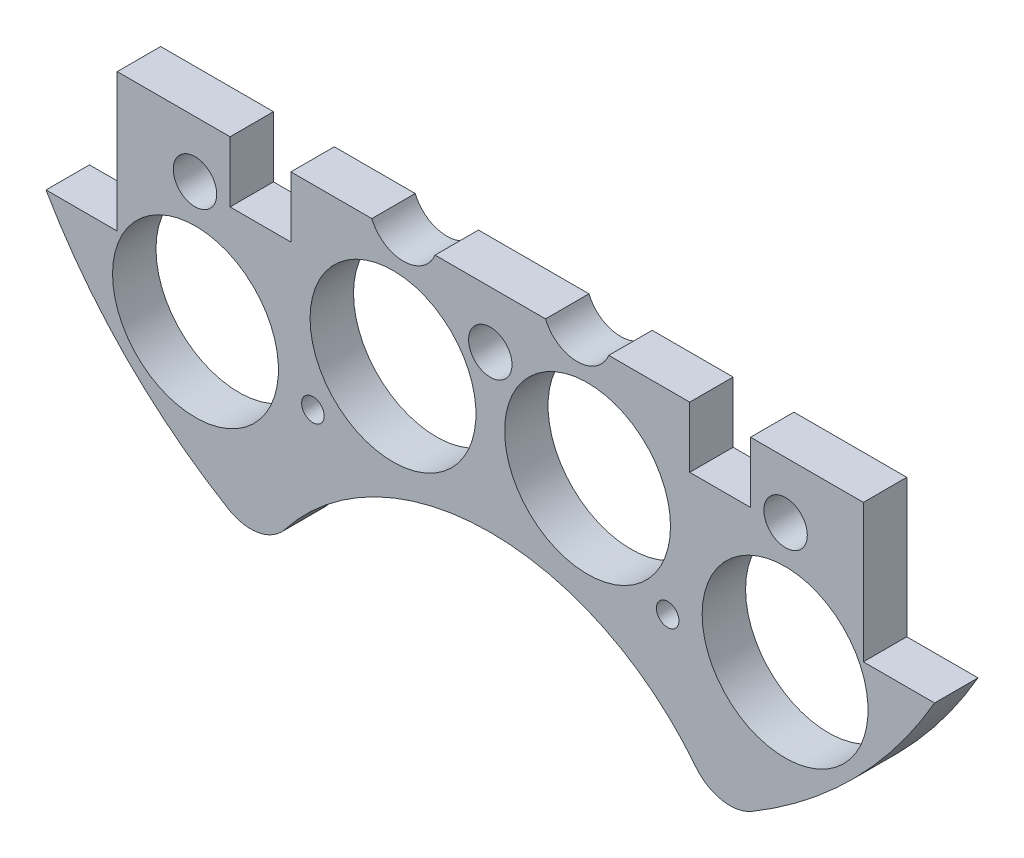
ISO-10303-21;
HEADER;
FILE_DESCRIPTION(('STEP AP214'),'2;1');
FILE_NAME('part.step','',(''),(''),'','','');
FILE_SCHEMA(('AUTOMOTIVE_DESIGN { 1 0 10303 214 1 1 1 1 }'));
ENDSEC;
DATA;
#1=APPLICATION_CONTEXT('core data for automotive mechanical design processes');
#2=APPLICATION_PROTOCOL_DEFINITION('international standard','automotive_design',2000,#1);
#3=PRODUCT_CONTEXT('',#1,'mechanical');
#4=PRODUCT('Part','Part','',(#3));
#5=PRODUCT_RELATED_PRODUCT_CATEGORY('part','',(#4));
#6=PRODUCT_DEFINITION_FORMATION('','',#4);
#7=PRODUCT_DEFINITION_CONTEXT('part definition',#1,'design');
#8=PRODUCT_DEFINITION('design','',#6,#7);
#9=PRODUCT_DEFINITION_SHAPE('','',#8);
#10=(LENGTH_UNIT() NAMED_UNIT(*) SI_UNIT(.MILLI.,.METRE.));
#11=(NAMED_UNIT(*) PLANE_ANGLE_UNIT() SI_UNIT($,.RADIAN.));
#12=(NAMED_UNIT(*) SI_UNIT($,.STERADIAN.) SOLID_ANGLE_UNIT());
#13=UNCERTAINTY_MEASURE_WITH_UNIT(LENGTH_MEASURE(1.E-05),#10,'distance_accuracy_value','');
#14=(GEOMETRIC_REPRESENTATION_CONTEXT(3) GLOBAL_UNCERTAINTY_ASSIGNED_CONTEXT((#13)) GLOBAL_UNIT_ASSIGNED_CONTEXT((#10,
#11,#12)) REPRESENTATION_CONTEXT('',''));
#15=CARTESIAN_POINT('',(0.,0.,0.));
#16=DIRECTION('',(0.,0.,1.));
#17=DIRECTION('',(1.,0.,0.));
#18=AXIS2_PLACEMENT_3D('',#15,#16,#17);
#19=CARTESIAN_POINT('',(85.0440360772851,-17.145,6.35));
#20=DIRECTION('',(0.,-1.,0.));
#21=DIRECTION('',(0.,0.,-1.));
#22=AXIS2_PLACEMENT_3D('',#19,#20,#21);
#23=PLANE('',#22);
#24=DIRECTION('',(-1.,0.,0.));
#25=VECTOR('',#24,1.);
#26=CARTESIAN_POINT('',(85.0440360772851,-17.145,6.35));
#27=LINE('',#26,#25);
#28=CARTESIAN_POINT('',(-17.3228751875862,-17.145,6.35));
#29=VERTEX_POINT('',#28);
#30=CARTESIAN_POINT('',(-29.1604414737786,-17.145,6.35));
#31=VERTEX_POINT('',#30);
#32=EDGE_CURVE('E197',#29,#31,#27,.T.);
#33=ORIENTED_EDGE('',*,*,#32,.F.);
#34=DIRECTION('',(0.,0.,-1.));
#35=VECTOR('',#34,1.);
#36=CARTESIAN_POINT('',(-17.3228751875862,-17.145,10.));
#37=LINE('',#36,#35);
#38=CARTESIAN_POINT('',(-17.3228751875862,-17.145,0.));
#39=VERTEX_POINT('',#38);
#40=EDGE_CURVE('E183',#29,#39,#37,.T.);
#41=ORIENTED_EDGE('',*,*,#40,.T.);
#42=DIRECTION('',(-1.,0.,0.));
#43=VECTOR('',#42,1.);
#44=CARTESIAN_POINT('',(85.0440360772851,-17.145,0.));
#45=LINE('',#44,#43);
#46=CARTESIAN_POINT('',(-29.1604414737786,-17.145,0.));
#47=VERTEX_POINT('',#46);
#48=EDGE_CURVE('E195',#39,#47,#45,.T.);
#49=ORIENTED_EDGE('',*,*,#48,.T.);
#50=DIRECTION('',(0.,0.,-1.));
#51=VECTOR('',#50,1.);
#52=CARTESIAN_POINT('',(-29.1604414737786,-17.145,6.35));
#53=LINE('',#52,#51);
#54=EDGE_CURVE('E256',#31,#47,#53,.T.);
#55=ORIENTED_EDGE('',*,*,#54,.F.);
#56=EDGE_LOOP('',(#33,#41,#49,#55));
#57=FACE_BOUND('',#56,.T.);
#58=ADVANCED_FACE('F33',(#57),#23,.F.);
#59=CARTESIAN_POINT('',(8.07712481241381,-17.145,0.));
#60=VERTEX_POINT('',#59);
#61=CARTESIAN_POINT('',(-8.07712481241381,-17.145,0.));
#62=VERTEX_POINT('',#61);
#63=EDGE_CURVE('E205',#60,#62,#45,.T.);
#64=ORIENTED_EDGE('',*,*,#63,.T.);
#65=DIRECTION('',(0.,0.,-1.));
#66=VECTOR('',#65,1.);
#67=CARTESIAN_POINT('',(-8.07712481241381,-17.145,10.));
#68=LINE('',#67,#66);
#69=CARTESIAN_POINT('',(-8.07712481241381,-17.145,6.35));
#70=VERTEX_POINT('',#69);
#71=EDGE_CURVE('E50',#62,#70,#68,.F.);
#72=ORIENTED_EDGE('',*,*,#71,.T.);
#73=CARTESIAN_POINT('',(8.07712481241381,-17.145,6.35));
#74=VERTEX_POINT('',#73);
#75=EDGE_CURVE('E219',#74,#70,#27,.T.);
#76=ORIENTED_EDGE('',*,*,#75,.F.);
#77=DIRECTION('',(0.,0.,-1.));
#78=VECTOR('',#77,1.);
#79=CARTESIAN_POINT('',(8.07712481241381,-17.145,10.));
#80=LINE('',#79,#78);
#81=EDGE_CURVE('E238',#74,#60,#80,.T.);
#82=ORIENTED_EDGE('',*,*,#81,.T.);
#83=EDGE_LOOP('',(#64,#72,#76,#82));
#84=FACE_BOUND('',#83,.T.);
#85=ADVANCED_FACE('F304',(#84),#23,.F.);
#86=CARTESIAN_POINT('',(29.1604414737786,-17.145,0.));
#87=VERTEX_POINT('',#86);
#88=CARTESIAN_POINT('',(17.3228751875862,-17.145,0.));
#89=VERTEX_POINT('',#88);
#90=EDGE_CURVE('E209',#87,#89,#45,.T.);
#91=ORIENTED_EDGE('',*,*,#90,.T.);
#92=DIRECTION('',(0.,0.,-1.));
#93=VECTOR('',#92,1.);
#94=CARTESIAN_POINT('',(17.3228751875862,-17.145,10.));
#95=LINE('',#94,#93);
#96=CARTESIAN_POINT('',(17.3228751875862,-17.145,6.35));
#97=VERTEX_POINT('',#96);
#98=EDGE_CURVE('E58',#89,#97,#95,.F.);
#99=ORIENTED_EDGE('',*,*,#98,.T.);
#100=CARTESIAN_POINT('',(29.1604414737786,-17.145,6.35));
#101=VERTEX_POINT('',#100);
#102=EDGE_CURVE('E218',#101,#97,#27,.T.);
#103=ORIENTED_EDGE('',*,*,#102,.F.);
#104=DIRECTION('',(0.,0.,-1.));
#105=VECTOR('',#104,1.);
#106=CARTESIAN_POINT('',(29.1604414737786,-17.145,6.35));
#107=LINE('',#106,#105);
#108=EDGE_CURVE('E227',#101,#87,#107,.T.);
#109=ORIENTED_EDGE('',*,*,#108,.T.);
#110=EDGE_LOOP('',(#91,#99,#103,#109));
#111=FACE_BOUND('',#110,.T.);
#112=ADVANCED_FACE('F224',(#111),#23,.F.);
#113=CARTESIAN_POINT('',(54.5504414737786,-17.145,0.));
#114=VERTEX_POINT('',#113);
#115=CARTESIAN_POINT('',(38.0504414737786,-17.145,0.));
#116=VERTEX_POINT('',#115);
#117=EDGE_CURVE('E208',#114,#116,#45,.T.);
#118=ORIENTED_EDGE('',*,*,#117,.T.);
#119=DIRECTION('',(0.,0.,-1.));
#120=VECTOR('',#119,1.);
#121=CARTESIAN_POINT('',(38.0504414737786,-17.145,6.35));
#122=LINE('',#121,#120);
#123=CARTESIAN_POINT('',(38.0504414737786,-17.145,6.35));
#124=VERTEX_POINT('',#123);
#125=EDGE_CURVE('E281',#124,#116,#122,.T.);
#126=ORIENTED_EDGE('',*,*,#125,.F.);
#127=CARTESIAN_POINT('',(54.5504414737786,-17.145,6.35));
#128=VERTEX_POINT('',#127);
#129=EDGE_CURVE('E290',#128,#124,#27,.T.);
#130=ORIENTED_EDGE('',*,*,#129,.F.);
#131=DIRECTION('',(0.,0.,1.));
#132=VECTOR('',#131,1.);
#133=CARTESIAN_POINT('',(54.5504414737786,-17.145,6.35));
#134=LINE('',#133,#132);
#135=EDGE_CURVE('E670',#114,#128,#134,.T.);
#136=ORIENTED_EDGE('',*,*,#135,.F.);
#137=EDGE_LOOP('',(#118,#126,#130,#136));
#138=FACE_BOUND('',#137,.T.);
#139=ADVANCED_FACE('F354',(#138),#23,.F.);
#140=CARTESIAN_POINT('',(0.,0.,6.35));
#141=DIRECTION('',(0.,0.,-1.));
#142=DIRECTION('',(-1.,0.,0.));
#143=AXIS2_PLACEMENT_3D('',#140,#141,#142);
#144=CYLINDRICAL_SURFACE('',#143,74.93);
#145=CARTESIAN_POINT('',(0.,0.,0.));
#146=DIRECTION('',(0.,0.,1.));
#147=DIRECTION('',(1.,0.,0.));
#148=AXIS2_PLACEMENT_3D('',#145,#146,#147);
#149=CIRCLE('',#148,74.93);
#150=CARTESIAN_POINT('',(-64.9644414737785,-37.338,0.));
#151=VERTEX_POINT('',#150);
#152=CARTESIAN_POINT('',(-38.2787319784796,-64.4146223936749,0.));
#153=VERTEX_POINT('',#152);
#154=EDGE_CURVE('E652',#151,#153,#149,.T.);
#155=ORIENTED_EDGE('',*,*,#154,.T.);
#156=DIRECTION('',(0.,0.,-1.));
#157=VECTOR('',#156,1.);
#158=CARTESIAN_POINT('',(-38.2787319784796,-64.4146223936749,6.35));
#159=LINE('',#158,#157);
#160=CARTESIAN_POINT('',(-38.2787319784796,-64.4146223936749,6.35));
#161=VERTEX_POINT('',#160);
#162=EDGE_CURVE('E673',#153,#161,#159,.F.);
#163=ORIENTED_EDGE('',*,*,#162,.T.);
#164=CARTESIAN_POINT('',(0.,0.,6.35));
#165=DIRECTION('',(0.,0.,1.));
#166=DIRECTION('',(1.,0.,0.));
#167=AXIS2_PLACEMENT_3D('',#164,#165,#166);
#168=CIRCLE('',#167,74.93);
#169=CARTESIAN_POINT('',(-64.9644414737785,-37.338,6.35));
#170=VERTEX_POINT('',#169);
#171=EDGE_CURVE('E640',#170,#161,#168,.T.);
#172=ORIENTED_EDGE('',*,*,#171,.F.);
#173=DIRECTION('',(0.,0.,-1.));
#174=VECTOR('',#173,1.);
#175=CARTESIAN_POINT('',(-64.9644414737785,-37.338,6.35));
#176=LINE('',#175,#174);
#177=EDGE_CURVE('E664',#170,#151,#176,.T.);
#178=ORIENTED_EDGE('',*,*,#177,.T.);
#179=EDGE_LOOP('',(#155,#163,#172,#178));
#180=FACE_BOUND('',#179,.T.);
#181=ADVANCED_FACE('F366',(#180),#144,.T.);
#182=CARTESIAN_POINT('',(0.,0.,6.35));
#183=DIRECTION('',(0.,0.,1.));
#184=DIRECTION('',(1.,0.,0.));
#185=AXIS2_PLACEMENT_3D('',#182,#183,#184);
#186=PLANE('',#185);
#187=CARTESIAN_POINT('',(-25.9376089894497,-45.645229381132,6.34999999999999));
#188=DIRECTION('',(0.,0.,1.));
#189=DIRECTION('',(1.,0.,0.));
#190=AXIS2_PLACEMENT_3D('',#187,#188,#189);
#191=CIRCLE('',#190,1.651);
#192=CARTESIAN_POINT('',(-24.2866089894497,-45.645229381132,6.34999999999999));
#193=VERTEX_POINT('',#192);
#194=EDGE_CURVE('E322',#193,#193,#191,.T.);
#195=ORIENTED_EDGE('',*,*,#194,.F.);
#196=EDGE_LOOP('',(#195));
#197=FACE_BOUND('',#196,.T.);
#198=CARTESIAN_POINT('',(25.9376089894497,-45.645229381132,6.34999999999999));
#199=DIRECTION('',(0.,0.,1.));
#200=DIRECTION('',(1.,0.,0.));
#201=AXIS2_PLACEMENT_3D('',#198,#199,#200);
#202=CIRCLE('',#201,1.651);
#203=CARTESIAN_POINT('',(27.5886089894497,-45.645229381132,6.34999999999999));
#204=VERTEX_POINT('',#203);
#205=EDGE_CURVE('E318',#204,#204,#202,.T.);
#206=ORIENTED_EDGE('',*,*,#205,.F.);
#207=EDGE_LOOP('',(#206));
#208=FACE_BOUND('',#207,.T.);
#209=CARTESIAN_POINT('',(-43.18,-25.4,6.34999999999999));
#210=DIRECTION('',(0.,0.,1.));
#211=DIRECTION('',(1.,0.,0.));
#212=AXIS2_PLACEMENT_3D('',#209,#210,#211);
#213=CIRCLE('',#212,3.175);
#214=CARTESIAN_POINT('',(-40.005,-25.4,6.34999999999999));
#215=VERTEX_POINT('',#214);
#216=EDGE_CURVE('E190',#215,#215,#213,.F.);
#217=ORIENTED_EDGE('',*,*,#216,.T.);
#218=EDGE_LOOP('',(#217));
#219=FACE_BOUND('',#218,.T.);
#220=CARTESIAN_POINT('',(0.,-25.4,6.34999999999999));
#221=DIRECTION('',(0.,0.,1.));
#222=DIRECTION('',(1.,0.,0.));
#223=AXIS2_PLACEMENT_3D('',#220,#221,#222);
#224=CIRCLE('',#223,3.175);
#225=CARTESIAN_POINT('',(3.17500000000001,-25.4,6.34999999999999));
#226=VERTEX_POINT('',#225);
#227=EDGE_CURVE('E310',#226,#226,#224,.F.);
#228=ORIENTED_EDGE('',*,*,#227,.T.);
#229=EDGE_LOOP('',(#228));
#230=FACE_BOUND('',#229,.T.);
#231=CARTESIAN_POINT('',(43.18,-25.4,6.34999999999999));
#232=DIRECTION('',(0.,0.,1.));
#233=DIRECTION('',(1.,0.,0.));
#234=AXIS2_PLACEMENT_3D('',#231,#232,#233);
#235=CIRCLE('',#234,3.175);
#236=CARTESIAN_POINT('',(46.355,-25.4,6.34999999999999));
#237=VERTEX_POINT('',#236);
#238=EDGE_CURVE('E314',#237,#237,#235,.F.);
#239=ORIENTED_EDGE('',*,*,#238,.T.);
#240=EDGE_LOOP('',(#239));
#241=FACE_BOUND('',#240,.T.);
#242=CARTESIAN_POINT('',(-12.7,-15.24,6.35));
#243=DIRECTION('',(0.,0.,1.));
#244=DIRECTION('',(1.,0.,0.));
#245=AXIS2_PLACEMENT_3D('',#242,#243,#244);
#246=CIRCLE('',#245,5.);
#247=EDGE_CURVE('E189',#29,#70,#246,.T.);
#248=ORIENTED_EDGE('',*,*,#247,.F.);
#249=ORIENTED_EDGE('',*,*,#32,.T.);
#250=DIRECTION('',(0.,-1.,0.));
#251=VECTOR('',#250,1.);
#252=CARTESIAN_POINT('',(-29.1604414737786,-17.145,6.35));
#253=LINE('',#252,#251);
#254=CARTESIAN_POINT('',(-29.1604414737786,-26.035,6.35));
#255=VERTEX_POINT('',#254);
#256=EDGE_CURVE('E240',#31,#255,#253,.T.);
#257=ORIENTED_EDGE('',*,*,#256,.T.);
#258=DIRECTION('',(-1.,0.,0.));
#259=VECTOR('',#258,1.);
#260=CARTESIAN_POINT('',(-29.1604414737786,-26.035,6.35));
#261=LINE('',#260,#259);
#262=CARTESIAN_POINT('',(-38.0504414737786,-26.035,6.35));
#263=VERTEX_POINT('',#262);
#264=EDGE_CURVE('E243',#255,#263,#261,.T.);
#265=ORIENTED_EDGE('',*,*,#264,.T.);
#266=DIRECTION('',(0.,1.,0.));
#267=VECTOR('',#266,1.);
#268=CARTESIAN_POINT('',(-38.0504414737786,-17.145,6.35));
#269=LINE('',#268,#267);
#270=CARTESIAN_POINT('',(-38.0504414737786,-17.145,6.35));
#271=VERTEX_POINT('',#270);
#272=EDGE_CURVE('E247',#263,#271,#269,.T.);
#273=ORIENTED_EDGE('',*,*,#272,.T.);
#274=CARTESIAN_POINT('',(-54.5504414737786,-17.145,6.35));
#275=VERTEX_POINT('',#274);
#276=EDGE_CURVE('E214',#271,#275,#27,.T.);
#277=ORIENTED_EDGE('',*,*,#276,.T.);
#278=DIRECTION('',(0.,-1.,0.));
#279=VECTOR('',#278,1.);
#280=CARTESIAN_POINT('',(-54.5504414737786,37.338,6.35));
#281=LINE('',#280,#279);
#282=CARTESIAN_POINT('',(-54.5504414737786,-37.338,6.35));
#283=VERTEX_POINT('',#282);
#284=EDGE_CURVE('E634',#275,#283,#281,.T.);
#285=ORIENTED_EDGE('',*,*,#284,.T.);
#286=DIRECTION('',(-1.,0.,0.));
#287=VECTOR('',#286,1.);
#288=CARTESIAN_POINT('',(-64.9644414737785,-37.338,6.35));
#289=LINE('',#288,#287);
#290=EDGE_CURVE('E636',#283,#170,#289,.T.);
#291=ORIENTED_EDGE('',*,*,#290,.T.);
#292=ORIENTED_EDGE('',*,*,#171,.T.);
#293=CARTESIAN_POINT('',(-35.0347716413203,-58.9557560891262,6.35));
#294=DIRECTION('',(0.,0.,1.));
#295=DIRECTION('',(1.,0.,0.));
#296=AXIS2_PLACEMENT_3D('',#293,#294,#295);
#297=CIRCLE('',#296,6.35);
#298=CARTESIAN_POINT('',(-30.0298042639888,-62.8637992761762,6.35));
#299=VERTEX_POINT('',#298);
#300=EDGE_CURVE('E676',#161,#299,#297,.T.);
#301=ORIENTED_EDGE('',*,*,#300,.T.);
#302=CARTESIAN_POINT('',(0.,-86.312058398476,6.35));
#303=DIRECTION('',(0.,0.,1.));
#304=DIRECTION('',(1.,0.,0.));
#305=AXIS2_PLACEMENT_3D('',#302,#303,#304);
#306=CIRCLE('',#305,38.1);
#307=CARTESIAN_POINT('',(30.0298042639888,-62.8637992761762,6.35));
#308=VERTEX_POINT('',#307);
#309=EDGE_CURVE('E210',#308,#299,#306,.T.);
#310=ORIENTED_EDGE('',*,*,#309,.F.);
#311=CARTESIAN_POINT('',(35.0347716413203,-58.9557560891262,6.35));
#312=DIRECTION('',(0.,0.,1.));
#313=DIRECTION('',(1.,0.,0.));
#314=AXIS2_PLACEMENT_3D('',#311,#312,#313);
#315=CIRCLE('',#314,6.35);
#316=CARTESIAN_POINT('',(38.2787319784796,-64.4146223936749,6.35));
#317=VERTEX_POINT('',#316);
#318=EDGE_CURVE('E11',#308,#317,#315,.T.);
#319=ORIENTED_EDGE('',*,*,#318,.T.);
#320=CARTESIAN_POINT('',(64.9644414737785,-37.338,6.35));
#321=VERTEX_POINT('',#320);
#322=EDGE_CURVE('E639',#317,#321,#168,.T.);
#323=ORIENTED_EDGE('',*,*,#322,.T.);
#324=DIRECTION('',(-1.,0.,0.));
#325=VECTOR('',#324,1.);
#326=CARTESIAN_POINT('',(64.9644414737785,-37.338,6.35));
#327=LINE('',#326,#325);
#328=CARTESIAN_POINT('',(54.5504414737786,-37.338,6.35));
#329=VERTEX_POINT('',#328);
#330=EDGE_CURVE('E643',#321,#329,#327,.T.);
#331=ORIENTED_EDGE('',*,*,#330,.T.);
#332=DIRECTION('',(0.,1.,0.));
#333=VECTOR('',#332,1.);
#334=CARTESIAN_POINT('',(54.5504414737786,37.338,6.35));
#335=LINE('',#334,#333);
#336=EDGE_CURVE('E645',#329,#128,#335,.T.);
#337=ORIENTED_EDGE('',*,*,#336,.T.);
#338=ORIENTED_EDGE('',*,*,#129,.T.);
#339=DIRECTION('',(0.,-1.,0.));
#340=VECTOR('',#339,1.);
#341=CARTESIAN_POINT('',(38.0504414737786,-17.145,6.35));
#342=LINE('',#341,#340);
#343=CARTESIAN_POINT('',(38.0504414737786,-26.035,6.35));
#344=VERTEX_POINT('',#343);
#345=EDGE_CURVE('E265',#124,#344,#342,.T.);
#346=ORIENTED_EDGE('',*,*,#345,.T.);
#347=DIRECTION('',(-1.,0.,0.));
#348=VECTOR('',#347,1.);
#349=CARTESIAN_POINT('',(38.0504414737786,-26.035,6.35));
#350=LINE('',#349,#348);
#351=CARTESIAN_POINT('',(29.1604414737786,-26.035,6.35));
#352=VERTEX_POINT('',#351);
#353=EDGE_CURVE('E268',#344,#352,#350,.T.);
#354=ORIENTED_EDGE('',*,*,#353,.T.);
#355=DIRECTION('',(0.,1.,0.));
#356=VECTOR('',#355,1.);
#357=CARTESIAN_POINT('',(29.1604414737786,-17.145,6.35));
#358=LINE('',#357,#356);
#359=EDGE_CURVE('E271',#352,#101,#358,.T.);
#360=ORIENTED_EDGE('',*,*,#359,.T.);
#361=ORIENTED_EDGE('',*,*,#102,.T.);
#362=CARTESIAN_POINT('',(12.7,-15.24,6.35));
#363=DIRECTION('',(0.,0.,1.));
#364=DIRECTION('',(1.,0.,0.));
#365=AXIS2_PLACEMENT_3D('',#362,#363,#364);
#366=CIRCLE('',#365,5.);
#367=EDGE_CURVE('E232',#74,#97,#366,.T.);
#368=ORIENTED_EDGE('',*,*,#367,.F.);
#369=ORIENTED_EDGE('',*,*,#75,.T.);
#370=EDGE_LOOP('',(#248,#249,#257,#265,#273,#277,#285,#291,#292,#301,#310,#319,#323,#331,#337,
#338,#346,#354,#360,#361,#368,#369));
#371=FACE_BOUND('',#370,.T.);
#372=CARTESIAN_POINT('',(-43.105229381132,-43.1052293811318,6.35));
#373=DIRECTION('',(0.,0.,-1.));
#374=DIRECTION('',(-1.,0.,0.));
#375=AXIS2_PLACEMENT_3D('',#372,#373,#374);
#376=CIRCLE('',#375,12.1285);
#377=CARTESIAN_POINT('',(-55.233729381132,-43.1052293811318,6.35));
#378=VERTEX_POINT('',#377);
#379=EDGE_CURVE('E722',#378,#378,#376,.T.);
#380=ORIENTED_EDGE('',*,*,#379,.T.);
#381=EDGE_LOOP('',(#380));
#382=FACE_BOUND('',#381,.T.);
#383=CARTESIAN_POINT('',(14.224,-34.29,6.35));
#384=DIRECTION('',(0.,0.,-1.));
#385=DIRECTION('',(1.,0.,0.));
#386=AXIS2_PLACEMENT_3D('',#383,#384,#385);
#387=CIRCLE('',#386,12.1285);
#388=CARTESIAN_POINT('',(26.3525,-34.29,6.35));
#389=VERTEX_POINT('',#388);
#390=EDGE_CURVE('E719',#389,#389,#387,.T.);
#391=ORIENTED_EDGE('',*,*,#390,.T.);
#392=EDGE_LOOP('',(#391));
#393=FACE_BOUND('',#392,.T.);
#394=CARTESIAN_POINT('',(43.1052293811319,-43.105229381132,6.35));
#395=DIRECTION('',(0.,0.,-1.));
#396=DIRECTION('',(-1.,0.,0.));
#397=AXIS2_PLACEMENT_3D('',#394,#395,#396);
#398=CIRCLE('',#397,12.1285);
#399=CARTESIAN_POINT('',(30.9767293811319,-43.105229381132,6.35));
#400=VERTEX_POINT('',#399);
#401=EDGE_CURVE('E625',#400,#400,#398,.T.);
#402=ORIENTED_EDGE('',*,*,#401,.T.);
#403=EDGE_LOOP('',(#402));
#404=FACE_BOUND('',#403,.T.);
#405=CARTESIAN_POINT('',(-14.224,-34.29,6.35));
#406=DIRECTION('',(0.,0.,-1.));
#407=DIRECTION('',(-1.,0.,0.));
#408=AXIS2_PLACEMENT_3D('',#405,#406,#407);
#409=CIRCLE('',#408,12.1285);
#410=CARTESIAN_POINT('',(-26.3525,-34.29,6.35));
#411=VERTEX_POINT('',#410);
#412=EDGE_CURVE('E624',#411,#411,#409,.T.);
#413=ORIENTED_EDGE('',*,*,#412,.T.);
#414=EDGE_LOOP('',(#413));
#415=FACE_BOUND('',#414,.T.);
#416=ADVANCED_FACE('F301',(#197,#208,#219,#230,#241,#371,#382,#393,#404,#415),#186,.T.);
#417=CARTESIAN_POINT('',(0.,0.,0.));
#418=DIRECTION('',(0.,0.,1.));
#419=DIRECTION('',(1.,0.,0.));
#420=AXIS2_PLACEMENT_3D('',#417,#418,#419);
#421=PLANE('',#420);
#422=CARTESIAN_POINT('',(-25.9376089894497,-45.645229381132,0.));
#423=DIRECTION('',(0.,0.,1.));
#424=DIRECTION('',(1.,0.,0.));
#425=AXIS2_PLACEMENT_3D('',#422,#423,#424);
#426=CIRCLE('',#425,1.651);
#427=CARTESIAN_POINT('',(-24.2866089894497,-45.645229381132,0.));
#428=VERTEX_POINT('',#427);
#429=EDGE_CURVE('E37',#428,#428,#426,.T.);
#430=ORIENTED_EDGE('',*,*,#429,.T.);
#431=EDGE_LOOP('',(#430));
#432=FACE_BOUND('',#431,.T.);
#433=CARTESIAN_POINT('',(25.9376089894497,-45.645229381132,0.));
#434=DIRECTION('',(0.,0.,1.));
#435=DIRECTION('',(1.,0.,0.));
#436=AXIS2_PLACEMENT_3D('',#433,#434,#435);
#437=CIRCLE('',#436,1.651);
#438=CARTESIAN_POINT('',(27.5886089894497,-45.645229381132,0.));
#439=VERTEX_POINT('',#438);
#440=EDGE_CURVE('E321',#439,#439,#437,.T.);
#441=ORIENTED_EDGE('',*,*,#440,.T.);
#442=EDGE_LOOP('',(#441));
#443=FACE_BOUND('',#442,.T.);
#444=CARTESIAN_POINT('',(-43.18,-25.4,0.));
#445=DIRECTION('',(0.,0.,1.));
#446=DIRECTION('',(1.,0.,0.));
#447=AXIS2_PLACEMENT_3D('',#444,#445,#446);
#448=CIRCLE('',#447,3.175);
#449=CARTESIAN_POINT('',(-40.005,-25.4,0.));
#450=VERTEX_POINT('',#449);
#451=EDGE_CURVE('E309',#450,#450,#448,.F.);
#452=ORIENTED_EDGE('',*,*,#451,.F.);
#453=EDGE_LOOP('',(#452));
#454=FACE_BOUND('',#453,.T.);
#455=CARTESIAN_POINT('',(0.,-25.4,0.));
#456=DIRECTION('',(0.,0.,1.));
#457=DIRECTION('',(1.,0.,0.));
#458=AXIS2_PLACEMENT_3D('',#455,#456,#457);
#459=CIRCLE('',#458,3.175);
#460=CARTESIAN_POINT('',(3.17500000000001,-25.4,0.));
#461=VERTEX_POINT('',#460);
#462=EDGE_CURVE('E313',#461,#461,#459,.F.);
#463=ORIENTED_EDGE('',*,*,#462,.F.);
#464=EDGE_LOOP('',(#463));
#465=FACE_BOUND('',#464,.T.);
#466=CARTESIAN_POINT('',(43.18,-25.4,0.));
#467=DIRECTION('',(0.,0.,1.));
#468=DIRECTION('',(1.,0.,0.));
#469=AXIS2_PLACEMENT_3D('',#466,#467,#468);
#470=CIRCLE('',#469,3.175);
#471=CARTESIAN_POINT('',(46.355,-25.4,0.));
#472=VERTEX_POINT('',#471);
#473=EDGE_CURVE('E317',#472,#472,#470,.F.);
#474=ORIENTED_EDGE('',*,*,#473,.F.);
#475=EDGE_LOOP('',(#474));
#476=FACE_BOUND('',#475,.T.);
#477=CARTESIAN_POINT('',(-43.105229381132,-43.1052293811318,0.));
#478=DIRECTION('',(0.,0.,-1.));
#479=DIRECTION('',(-1.,0.,0.));
#480=AXIS2_PLACEMENT_3D('',#477,#478,#479);
#481=CIRCLE('',#480,12.1285);
#482=CARTESIAN_POINT('',(-55.233729381132,-43.1052293811318,0.));
#483=VERTEX_POINT('',#482);
#484=EDGE_CURVE('E296',#483,#483,#481,.T.);
#485=ORIENTED_EDGE('',*,*,#484,.F.);
#486=EDGE_LOOP('',(#485));
#487=FACE_BOUND('',#486,.T.);
#488=CARTESIAN_POINT('',(14.224,-34.29,0.));
#489=DIRECTION('',(0.,0.,-1.));
#490=DIRECTION('',(1.,0.,0.));
#491=AXIS2_PLACEMENT_3D('',#488,#489,#490);
#492=CIRCLE('',#491,12.1285);
#493=CARTESIAN_POINT('',(26.3525,-34.29,0.));
#494=VERTEX_POINT('',#493);
#495=EDGE_CURVE('E615',#494,#494,#492,.T.);
#496=ORIENTED_EDGE('',*,*,#495,.F.);
#497=EDGE_LOOP('',(#496));
#498=FACE_BOUND('',#497,.T.);
#499=CARTESIAN_POINT('',(43.1052293811319,-43.105229381132,0.));
#500=DIRECTION('',(0.,0.,-1.));
#501=DIRECTION('',(-1.,0.,0.));
#502=AXIS2_PLACEMENT_3D('',#499,#500,#501);
#503=CIRCLE('',#502,12.1285);
#504=CARTESIAN_POINT('',(30.9767293811319,-43.105229381132,0.));
#505=VERTEX_POINT('',#504);
#506=EDGE_CURVE('E619',#505,#505,#503,.T.);
#507=ORIENTED_EDGE('',*,*,#506,.F.);
#508=EDGE_LOOP('',(#507));
#509=FACE_BOUND('',#508,.T.);
#510=CARTESIAN_POINT('',(-14.224,-34.29,0.));
#511=DIRECTION('',(0.,0.,-1.));
#512=DIRECTION('',(-1.,0.,0.));
#513=AXIS2_PLACEMENT_3D('',#510,#511,#512);
#514=CIRCLE('',#513,12.1285);
#515=CARTESIAN_POINT('',(-26.3525,-34.29,0.));
#516=VERTEX_POINT('',#515);
#517=EDGE_CURVE('E622',#516,#516,#514,.T.);
#518=ORIENTED_EDGE('',*,*,#517,.F.);
#519=EDGE_LOOP('',(#518));
#520=FACE_BOUND('',#519,.T.);
#521=ORIENTED_EDGE('',*,*,#48,.F.);
#522=CARTESIAN_POINT('',(-12.7,-15.24,0.));
#523=DIRECTION('',(0.,0.,-1.));
#524=DIRECTION('',(1.,0.,0.));
#525=AXIS2_PLACEMENT_3D('',#522,#523,#524);
#526=CIRCLE('',#525,5.);
#527=EDGE_CURVE('E180',#62,#39,#526,.T.);
#528=ORIENTED_EDGE('',*,*,#527,.F.);
#529=ORIENTED_EDGE('',*,*,#63,.F.);
#530=CARTESIAN_POINT('',(12.7,-15.24,0.));
#531=DIRECTION('',(0.,0.,-1.));
#532=DIRECTION('',(-1.,0.,0.));
#533=AXIS2_PLACEMENT_3D('',#530,#531,#532);
#534=CIRCLE('',#533,5.);
#535=EDGE_CURVE('E198',#89,#60,#534,.T.);
#536=ORIENTED_EDGE('',*,*,#535,.F.);
#537=ORIENTED_EDGE('',*,*,#90,.F.);
#538=DIRECTION('',(0.,1.,0.));
#539=VECTOR('',#538,1.);
#540=CARTESIAN_POINT('',(29.1604414737786,-17.145,0.));
#541=LINE('',#540,#539);
#542=CARTESIAN_POINT('',(29.1604414737786,-26.035,0.));
#543=VERTEX_POINT('',#542);
#544=EDGE_CURVE('E230',#543,#87,#541,.T.);
#545=ORIENTED_EDGE('',*,*,#544,.F.);
#546=DIRECTION('',(-1.,0.,0.));
#547=VECTOR('',#546,1.);
#548=CARTESIAN_POINT('',(38.0504414737786,-26.035,0.));
#549=LINE('',#548,#547);
#550=CARTESIAN_POINT('',(38.0504414737786,-26.035,0.));
#551=VERTEX_POINT('',#550);
#552=EDGE_CURVE('E277',#551,#543,#549,.T.);
#553=ORIENTED_EDGE('',*,*,#552,.F.);
#554=DIRECTION('',(0.,-1.,0.));
#555=VECTOR('',#554,1.);
#556=CARTESIAN_POINT('',(38.0504414737786,-17.145,0.));
#557=LINE('',#556,#555);
#558=EDGE_CURVE('E258',#116,#551,#557,.T.);
#559=ORIENTED_EDGE('',*,*,#558,.F.);
#560=ORIENTED_EDGE('',*,*,#117,.F.);
#561=DIRECTION('',(0.,1.,0.));
#562=VECTOR('',#561,1.);
#563=CARTESIAN_POINT('',(54.5504414737786,37.338,0.));
#564=LINE('',#563,#562);
#565=CARTESIAN_POINT('',(54.5504414737786,-37.338,0.));
#566=VERTEX_POINT('',#565);
#567=EDGE_CURVE('E637',#566,#114,#564,.T.);
#568=ORIENTED_EDGE('',*,*,#567,.F.);
#569=DIRECTION('',(-1.,0.,0.));
#570=VECTOR('',#569,1.);
#571=CARTESIAN_POINT('',(64.9644414737785,-37.338,0.));
#572=LINE('',#571,#570);
#573=CARTESIAN_POINT('',(64.9644414737785,-37.338,0.));
#574=VERTEX_POINT('',#573);
#575=EDGE_CURVE('E655',#574,#566,#572,.T.);
#576=ORIENTED_EDGE('',*,*,#575,.F.);
#577=CARTESIAN_POINT('',(38.2787319784796,-64.4146223936749,0.));
#578=VERTEX_POINT('',#577);
#579=EDGE_CURVE('E651',#578,#574,#149,.T.);
#580=ORIENTED_EDGE('',*,*,#579,.F.);
#581=CARTESIAN_POINT('',(35.0347716413203,-58.9557560891262,0.));
#582=DIRECTION('',(0.,0.,1.));
#583=DIRECTION('',(1.,0.,0.));
#584=AXIS2_PLACEMENT_3D('',#581,#582,#583);
#585=CIRCLE('',#584,6.35);
#586=CARTESIAN_POINT('',(30.0298042639888,-62.8637992761762,0.));
#587=VERTEX_POINT('',#586);
#588=EDGE_CURVE('E686',#578,#587,#585,.F.);
#589=ORIENTED_EDGE('',*,*,#588,.T.);
#590=CARTESIAN_POINT('',(0.,-86.312058398476,0.));
#591=DIRECTION('',(0.,0.,-1.));
#592=DIRECTION('',(-1.,0.,0.));
#593=AXIS2_PLACEMENT_3D('',#590,#591,#592);
#594=CIRCLE('',#593,38.1);
#595=CARTESIAN_POINT('',(-30.0298042639888,-62.8637992761762,0.));
#596=VERTEX_POINT('',#595);
#597=EDGE_CURVE('E283',#596,#587,#594,.T.);
#598=ORIENTED_EDGE('',*,*,#597,.F.);
#599=CARTESIAN_POINT('',(-35.0347716413203,-58.9557560891262,0.));
#600=DIRECTION('',(0.,0.,1.));
#601=DIRECTION('',(1.,0.,0.));
#602=AXIS2_PLACEMENT_3D('',#599,#600,#601);
#603=CIRCLE('',#602,6.35);
#604=EDGE_CURVE('E681',#596,#153,#603,.F.);
#605=ORIENTED_EDGE('',*,*,#604,.T.);
#606=ORIENTED_EDGE('',*,*,#154,.F.);
#607=DIRECTION('',(-1.,0.,0.));
#608=VECTOR('',#607,1.);
#609=CARTESIAN_POINT('',(-64.9644414737785,-37.338,0.));
#610=LINE('',#609,#608);
#611=CARTESIAN_POINT('',(-54.5504414737786,-37.338,0.));
#612=VERTEX_POINT('',#611);
#613=EDGE_CURVE('E649',#612,#151,#610,.T.);
#614=ORIENTED_EDGE('',*,*,#613,.F.);
#615=DIRECTION('',(0.,-1.,0.));
#616=VECTOR('',#615,1.);
#617=CARTESIAN_POINT('',(-54.5504414737786,37.338,0.));
#618=LINE('',#617,#616);
#619=CARTESIAN_POINT('',(-54.5504414737786,-17.145,0.));
#620=VERTEX_POINT('',#619);
#621=EDGE_CURVE('E628',#620,#612,#618,.T.);
#622=ORIENTED_EDGE('',*,*,#621,.F.);
#623=CARTESIAN_POINT('',(-38.0504414737786,-17.145,0.));
#624=VERTEX_POINT('',#623);
#625=EDGE_CURVE('E206',#624,#620,#45,.T.);
#626=ORIENTED_EDGE('',*,*,#625,.F.);
#627=DIRECTION('',(0.,1.,0.));
#628=VECTOR('',#627,1.);
#629=CARTESIAN_POINT('',(-38.0504414737786,-17.145,0.));
#630=LINE('',#629,#628);
#631=CARTESIAN_POINT('',(-38.0504414737786,-26.035,0.));
#632=VERTEX_POINT('',#631);
#633=EDGE_CURVE('E244',#632,#624,#630,.T.);
#634=ORIENTED_EDGE('',*,*,#633,.F.);
#635=DIRECTION('',(-1.,0.,0.));
#636=VECTOR('',#635,1.);
#637=CARTESIAN_POINT('',(-29.1604414737786,-26.035,0.));
#638=LINE('',#637,#636);
#639=CARTESIAN_POINT('',(-29.1604414737786,-26.035,0.));
#640=VERTEX_POINT('',#639);
#641=EDGE_CURVE('E252',#640,#632,#638,.T.);
#642=ORIENTED_EDGE('',*,*,#641,.F.);
#643=DIRECTION('',(0.,-1.,0.));
#644=VECTOR('',#643,1.);
#645=CARTESIAN_POINT('',(-29.1604414737786,-17.145,0.));
#646=LINE('',#645,#644);
#647=EDGE_CURVE('E204',#47,#640,#646,.T.);
#648=ORIENTED_EDGE('',*,*,#647,.F.);
#649=EDGE_LOOP('',(#521,#528,#529,#536,#537,#545,#553,#559,#560,#568,#576,#580,#589,#598,#605,
#606,#614,#622,#626,#634,#642,#648));
#650=FACE_BOUND('',#649,.T.);
#651=ADVANCED_FACE('F201',(#432,#443,#454,#465,#476,#487,#498,#509,#520,#650),#421,.F.);
#652=CARTESIAN_POINT('',(-54.5504414737786,37.338,6.35));
#653=DIRECTION('',(1.,0.,0.));
#654=DIRECTION('',(0.,1.,0.));
#655=AXIS2_PLACEMENT_3D('',#652,#653,#654);
#656=PLANE('',#655);
#657=ORIENTED_EDGE('',*,*,#284,.F.);
#658=DIRECTION('',(0.,0.,-1.));
#659=VECTOR('',#658,1.);
#660=CARTESIAN_POINT('',(-54.5504414737786,-17.145,6.35));
#661=LINE('',#660,#659);
#662=EDGE_CURVE('E292',#275,#620,#661,.T.);
#663=ORIENTED_EDGE('',*,*,#662,.T.);
#664=ORIENTED_EDGE('',*,*,#621,.T.);
#665=DIRECTION('',(0.,0.,-1.));
#666=VECTOR('',#665,1.);
#667=CARTESIAN_POINT('',(-54.5504414737786,-37.338,6.35));
#668=LINE('',#667,#666);
#669=EDGE_CURVE('E667',#283,#612,#668,.T.);
#670=ORIENTED_EDGE('',*,*,#669,.F.);
#671=EDGE_LOOP('',(#657,#663,#664,#670));
#672=FACE_BOUND('',#671,.T.);
#673=ADVANCED_FACE('F518',(#672),#656,.F.);
#674=CARTESIAN_POINT('',(-64.9644414737785,-37.338,6.35));
#675=DIRECTION('',(0.,-1.,0.));
#676=DIRECTION('',(0.,0.,-1.));
#677=AXIS2_PLACEMENT_3D('',#674,#675,#676);
#678=PLANE('',#677);
#679=ORIENTED_EDGE('',*,*,#613,.T.);
#680=ORIENTED_EDGE('',*,*,#177,.F.);
#681=ORIENTED_EDGE('',*,*,#290,.F.);
#682=ORIENTED_EDGE('',*,*,#669,.T.);
#683=EDGE_LOOP('',(#679,#680,#681,#682));
#684=FACE_BOUND('',#683,.T.);
#685=ADVANCED_FACE('F484',(#684),#678,.F.);
#686=ORIENTED_EDGE('',*,*,#322,.F.);
#687=DIRECTION('',(0.,0.,-1.));
#688=VECTOR('',#687,1.);
#689=CARTESIAN_POINT('',(38.2787319784796,-64.4146223936749,6.35));
#690=LINE('',#689,#688);
#691=EDGE_CURVE('E683',#317,#578,#690,.T.);
#692=ORIENTED_EDGE('',*,*,#691,.T.);
#693=ORIENTED_EDGE('',*,*,#579,.T.);
#694=DIRECTION('',(0.,0.,-1.));
#695=VECTOR('',#694,1.);
#696=CARTESIAN_POINT('',(64.9644414737785,-37.338,6.35));
#697=LINE('',#696,#695);
#698=EDGE_CURVE('E661',#321,#574,#697,.T.);
#699=ORIENTED_EDGE('',*,*,#698,.F.);
#700=EDGE_LOOP('',(#686,#692,#693,#699));
#701=FACE_BOUND('',#700,.T.);
#702=ADVANCED_FACE('F373',(#701),#144,.T.);
#703=CARTESIAN_POINT('',(64.9644414737785,-37.338,6.35));
#704=DIRECTION('',(0.,-1.,0.));
#705=DIRECTION('',(0.,0.,-1.));
#706=AXIS2_PLACEMENT_3D('',#703,#704,#705);
#707=PLANE('',#706);
#708=ORIENTED_EDGE('',*,*,#575,.T.);
#709=DIRECTION('',(0.,0.,-1.));
#710=VECTOR('',#709,1.);
#711=CARTESIAN_POINT('',(54.5504414737786,-37.338,6.35));
#712=LINE('',#711,#710);
#713=EDGE_CURVE('E647',#329,#566,#712,.T.);
#714=ORIENTED_EDGE('',*,*,#713,.F.);
#715=ORIENTED_EDGE('',*,*,#330,.F.);
#716=ORIENTED_EDGE('',*,*,#698,.T.);
#717=EDGE_LOOP('',(#708,#714,#715,#716));
#718=FACE_BOUND('',#717,.T.);
#719=ADVANCED_FACE('F483',(#718),#707,.F.);
#720=CARTESIAN_POINT('',(54.5504414737786,37.338,6.35));
#721=DIRECTION('',(-1.,0.,0.));
#722=DIRECTION('',(0.,-1.,0.));
#723=AXIS2_PLACEMENT_3D('',#720,#721,#722);
#724=PLANE('',#723);
#725=ORIENTED_EDGE('',*,*,#567,.T.);
#726=ORIENTED_EDGE('',*,*,#135,.T.);
#727=ORIENTED_EDGE('',*,*,#336,.F.);
#728=ORIENTED_EDGE('',*,*,#713,.T.);
#729=EDGE_LOOP('',(#725,#726,#727,#728));
#730=FACE_BOUND('',#729,.T.);
#731=ADVANCED_FACE('F505',(#730),#724,.F.);
#732=CARTESIAN_POINT('',(-14.224,-34.29,6.35));
#733=DIRECTION('',(0.,0.,-1.));
#734=DIRECTION('',(-1.,0.,0.));
#735=AXIS2_PLACEMENT_3D('',#732,#733,#734);
#736=CYLINDRICAL_SURFACE('',#735,12.1285);
#737=ORIENTED_EDGE('',*,*,#412,.F.);
#738=EDGE_LOOP('',(#737));
#739=FACE_BOUND('',#738,.T.);
#740=ORIENTED_EDGE('',*,*,#517,.T.);
#741=EDGE_LOOP('',(#740));
#742=FACE_BOUND('',#741,.T.);
#743=ADVANCED_FACE('F510',(#739,#742),#736,.F.);
#744=CARTESIAN_POINT('',(43.1052293811319,-43.105229381132,6.35));
#745=DIRECTION('',(0.,0.,-1.));
#746=DIRECTION('',(-1.,0.,0.));
#747=AXIS2_PLACEMENT_3D('',#744,#745,#746);
#748=CYLINDRICAL_SURFACE('',#747,12.1285);
#749=ORIENTED_EDGE('',*,*,#401,.F.);
#750=EDGE_LOOP('',(#749));
#751=FACE_BOUND('',#750,.T.);
#752=ORIENTED_EDGE('',*,*,#506,.T.);
#753=EDGE_LOOP('',(#752));
#754=FACE_BOUND('',#753,.T.);
#755=ADVANCED_FACE('F541',(#751,#754),#748,.F.);
#756=CARTESIAN_POINT('',(14.224,-34.29,6.35));
#757=DIRECTION('',(0.,0.,-1.));
#758=DIRECTION('',(-1.,0.,0.));
#759=AXIS2_PLACEMENT_3D('',#756,#757,#758);
#760=CYLINDRICAL_SURFACE('',#759,12.1285);
#761=ORIENTED_EDGE('',*,*,#390,.F.);
#762=EDGE_LOOP('',(#761));
#763=FACE_BOUND('',#762,.T.);
#764=ORIENTED_EDGE('',*,*,#495,.T.);
#765=EDGE_LOOP('',(#764));
#766=FACE_BOUND('',#765,.T.);
#767=ADVANCED_FACE('F361',(#763,#766),#760,.F.);
#768=CARTESIAN_POINT('',(-43.105229381132,-43.1052293811318,6.35));
#769=DIRECTION('',(0.,0.,-1.));
#770=DIRECTION('',(-1.,0.,0.));
#771=AXIS2_PLACEMENT_3D('',#768,#769,#770);
#772=CYLINDRICAL_SURFACE('',#771,12.1285);
#773=ORIENTED_EDGE('',*,*,#379,.F.);
#774=EDGE_LOOP('',(#773));
#775=FACE_BOUND('',#774,.T.);
#776=ORIENTED_EDGE('',*,*,#484,.T.);
#777=EDGE_LOOP('',(#776));
#778=FACE_BOUND('',#777,.T.);
#779=ADVANCED_FACE('F352',(#775,#778),#772,.F.);
#780=ORIENTED_EDGE('',*,*,#276,.F.);
#781=DIRECTION('',(0.,0.,-1.));
#782=VECTOR('',#781,1.);
#783=CARTESIAN_POINT('',(-38.0504414737786,-17.145,6.35));
#784=LINE('',#783,#782);
#785=EDGE_CURVE('E259',#271,#624,#784,.T.);
#786=ORIENTED_EDGE('',*,*,#785,.T.);
#787=ORIENTED_EDGE('',*,*,#625,.T.);
#788=ORIENTED_EDGE('',*,*,#662,.F.);
#789=EDGE_LOOP('',(#780,#786,#787,#788));
#790=FACE_BOUND('',#789,.T.);
#791=ADVANCED_FACE('F344',(#790),#23,.F.);
#792=CARTESIAN_POINT('',(0.,-86.312058398476,60.96));
#793=DIRECTION('',(0.,0.,-1.));
#794=DIRECTION('',(-1.,0.,0.));
#795=AXIS2_PLACEMENT_3D('',#792,#793,#794);
#796=CYLINDRICAL_SURFACE('',#795,38.1);
#797=ORIENTED_EDGE('',*,*,#597,.T.);
#798=DIRECTION('',(0.,0.,-1.));
#799=VECTOR('',#798,1.);
#800=CARTESIAN_POINT('',(30.0298042639888,-62.8637992761762,60.96));
#801=LINE('',#800,#799);
#802=EDGE_CURVE('E42',#587,#308,#801,.F.);
#803=ORIENTED_EDGE('',*,*,#802,.T.);
#804=ORIENTED_EDGE('',*,*,#309,.T.);
#805=DIRECTION('',(0.,0.,-1.));
#806=VECTOR('',#805,1.);
#807=CARTESIAN_POINT('',(-30.0298042639888,-62.8637992761762,60.96));
#808=LINE('',#807,#806);
#809=EDGE_CURVE('E679',#299,#596,#808,.T.);
#810=ORIENTED_EDGE('',*,*,#809,.T.);
#811=EDGE_LOOP('',(#797,#803,#804,#810));
#812=FACE_BOUND('',#811,.T.);
#813=ADVANCED_FACE('F351',(#812),#796,.F.);
#814=CARTESIAN_POINT('',(-35.0347716413203,-58.9557560891262,60.96));
#815=DIRECTION('',(0.,0.,-1.));
#816=DIRECTION('',(-1.,0.,0.));
#817=AXIS2_PLACEMENT_3D('',#814,#815,#816);
#818=CYLINDRICAL_SURFACE('',#817,6.35);
#819=ORIENTED_EDGE('',*,*,#604,.F.);
#820=ORIENTED_EDGE('',*,*,#809,.F.);
#821=ORIENTED_EDGE('',*,*,#300,.F.);
#822=ORIENTED_EDGE('',*,*,#162,.F.);
#823=EDGE_LOOP('',(#819,#820,#821,#822));
#824=FACE_BOUND('',#823,.T.);
#825=ADVANCED_FACE('F359',(#824),#818,.T.);
#826=CARTESIAN_POINT('',(35.0347716413203,-58.9557560891262,60.96));
#827=DIRECTION('',(0.,0.,1.));
#828=DIRECTION('',(1.,0.,0.));
#829=AXIS2_PLACEMENT_3D('',#826,#827,#828);
#830=CYLINDRICAL_SURFACE('',#829,6.35);
#831=ORIENTED_EDGE('',*,*,#318,.F.);
#832=ORIENTED_EDGE('',*,*,#802,.F.);
#833=ORIENTED_EDGE('',*,*,#588,.F.);
#834=ORIENTED_EDGE('',*,*,#691,.F.);
#835=EDGE_LOOP('',(#831,#832,#833,#834));
#836=FACE_BOUND('',#835,.T.);
#837=ADVANCED_FACE('F35',(#836),#830,.T.);
#838=CARTESIAN_POINT('',(38.0504414737786,-17.145,6.35));
#839=DIRECTION('',(1.,0.,0.));
#840=DIRECTION('',(0.,0.,-1.));
#841=AXIS2_PLACEMENT_3D('',#838,#839,#840);
#842=PLANE('',#841);
#843=ORIENTED_EDGE('',*,*,#558,.T.);
#844=DIRECTION('',(0.,0.,-1.));
#845=VECTOR('',#844,1.);
#846=CARTESIAN_POINT('',(38.0504414737786,-26.035,6.35));
#847=LINE('',#846,#845);
#848=EDGE_CURVE('E274',#344,#551,#847,.T.);
#849=ORIENTED_EDGE('',*,*,#848,.F.);
#850=ORIENTED_EDGE('',*,*,#345,.F.);
#851=ORIENTED_EDGE('',*,*,#125,.T.);
#852=EDGE_LOOP('',(#843,#849,#850,#851));
#853=FACE_BOUND('',#852,.T.);
#854=ADVANCED_FACE('F438',(#853),#842,.F.);
#855=CARTESIAN_POINT('',(29.1604414737786,-17.145,6.35));
#856=DIRECTION('',(-1.,0.,0.));
#857=DIRECTION('',(0.,-1.,0.));
#858=AXIS2_PLACEMENT_3D('',#855,#856,#857);
#859=PLANE('',#858);
#860=ORIENTED_EDGE('',*,*,#544,.T.);
#861=ORIENTED_EDGE('',*,*,#108,.F.);
#862=ORIENTED_EDGE('',*,*,#359,.F.);
#863=DIRECTION('',(0.,0.,-1.));
#864=VECTOR('',#863,1.);
#865=CARTESIAN_POINT('',(29.1604414737786,-26.035,6.35));
#866=LINE('',#865,#864);
#867=EDGE_CURVE('E285',#352,#543,#866,.T.);
#868=ORIENTED_EDGE('',*,*,#867,.T.);
#869=EDGE_LOOP('',(#860,#861,#862,#868));
#870=FACE_BOUND('',#869,.T.);
#871=ADVANCED_FACE('F428',(#870),#859,.F.);
#872=CARTESIAN_POINT('',(38.0504414737786,-26.035,6.35));
#873=DIRECTION('',(0.,-1.,0.));
#874=DIRECTION('',(0.,0.,-1.));
#875=AXIS2_PLACEMENT_3D('',#872,#873,#874);
#876=PLANE('',#875);
#877=ORIENTED_EDGE('',*,*,#552,.T.);
#878=ORIENTED_EDGE('',*,*,#867,.F.);
#879=ORIENTED_EDGE('',*,*,#353,.F.);
#880=ORIENTED_EDGE('',*,*,#848,.T.);
#881=EDGE_LOOP('',(#877,#878,#879,#880));
#882=FACE_BOUND('',#881,.T.);
#883=ADVANCED_FACE('F418',(#882),#876,.F.);
#884=CARTESIAN_POINT('',(-29.1604414737786,-17.145,6.35));
#885=DIRECTION('',(1.,0.,0.));
#886=DIRECTION('',(0.,1.,0.));
#887=AXIS2_PLACEMENT_3D('',#884,#885,#886);
#888=PLANE('',#887);
#889=ORIENTED_EDGE('',*,*,#647,.T.);
#890=DIRECTION('',(0.,0.,-1.));
#891=VECTOR('',#890,1.);
#892=CARTESIAN_POINT('',(-29.1604414737786,-26.035,6.35));
#893=LINE('',#892,#891);
#894=EDGE_CURVE('E250',#255,#640,#893,.T.);
#895=ORIENTED_EDGE('',*,*,#894,.F.);
#896=ORIENTED_EDGE('',*,*,#256,.F.);
#897=ORIENTED_EDGE('',*,*,#54,.T.);
#898=EDGE_LOOP('',(#889,#895,#896,#897));
#899=FACE_BOUND('',#898,.T.);
#900=ADVANCED_FACE('F408',(#899),#888,.F.);
#901=CARTESIAN_POINT('',(-38.0504414737786,-17.145,6.35));
#902=DIRECTION('',(-1.,0.,0.));
#903=DIRECTION('',(0.,0.,1.));
#904=AXIS2_PLACEMENT_3D('',#901,#902,#903);
#905=PLANE('',#904);
#906=ORIENTED_EDGE('',*,*,#633,.T.);
#907=ORIENTED_EDGE('',*,*,#785,.F.);
#908=ORIENTED_EDGE('',*,*,#272,.F.);
#909=DIRECTION('',(0.,0.,-1.));
#910=VECTOR('',#909,1.);
#911=CARTESIAN_POINT('',(-38.0504414737786,-26.035,6.35));
#912=LINE('',#911,#910);
#913=EDGE_CURVE('E262',#263,#632,#912,.T.);
#914=ORIENTED_EDGE('',*,*,#913,.T.);
#915=EDGE_LOOP('',(#906,#907,#908,#914));
#916=FACE_BOUND('',#915,.T.);
#917=ADVANCED_FACE('F397',(#916),#905,.F.);
#918=CARTESIAN_POINT('',(-29.1604414737786,-26.035,6.35));
#919=DIRECTION('',(0.,-1.,0.));
#920=DIRECTION('',(1.,0.,0.));
#921=AXIS2_PLACEMENT_3D('',#918,#919,#920);
#922=PLANE('',#921);
#923=ORIENTED_EDGE('',*,*,#641,.T.);
#924=ORIENTED_EDGE('',*,*,#913,.F.);
#925=ORIENTED_EDGE('',*,*,#264,.F.);
#926=ORIENTED_EDGE('',*,*,#894,.T.);
#927=EDGE_LOOP('',(#923,#924,#925,#926));
#928=FACE_BOUND('',#927,.T.);
#929=ADVANCED_FACE('F392',(#928),#922,.F.);
#930=CARTESIAN_POINT('',(12.7,-15.24,10.));
#931=DIRECTION('',(0.,0.,-1.));
#932=DIRECTION('',(-1.,0.,0.));
#933=AXIS2_PLACEMENT_3D('',#930,#931,#932);
#934=CYLINDRICAL_SURFACE('',#933,5.);
#935=ORIENTED_EDGE('',*,*,#367,.T.);
#936=ORIENTED_EDGE('',*,*,#98,.F.);
#937=ORIENTED_EDGE('',*,*,#535,.T.);
#938=ORIENTED_EDGE('',*,*,#81,.F.);
#939=EDGE_LOOP('',(#935,#936,#937,#938));
#940=FACE_BOUND('',#939,.T.);
#941=ADVANCED_FACE('F396',(#940),#934,.F.);
#942=CARTESIAN_POINT('',(-12.7,-15.24,10.));
#943=DIRECTION('',(0.,0.,-1.));
#944=DIRECTION('',(-1.,0.,0.));
#945=AXIS2_PLACEMENT_3D('',#942,#943,#944);
#946=CYLINDRICAL_SURFACE('',#945,5.);
#947=ORIENTED_EDGE('',*,*,#247,.T.);
#948=ORIENTED_EDGE('',*,*,#71,.F.);
#949=ORIENTED_EDGE('',*,*,#527,.T.);
#950=ORIENTED_EDGE('',*,*,#40,.F.);
#951=EDGE_LOOP('',(#947,#948,#949,#950));
#952=FACE_BOUND('',#951,.T.);
#953=ADVANCED_FACE('F182',(#952),#946,.F.);
#954=CARTESIAN_POINT('',(43.18,-25.4,-77.9780000000001));
#955=DIRECTION('',(0.,0.,1.));
#956=DIRECTION('',(1.,0.,0.));
#957=AXIS2_PLACEMENT_3D('',#954,#955,#956);
#958=CYLINDRICAL_SURFACE('',#957,3.175);
#959=ORIENTED_EDGE('',*,*,#238,.F.);
#960=EDGE_LOOP('',(#959));
#961=FACE_BOUND('',#960,.T.);
#962=ORIENTED_EDGE('',*,*,#473,.T.);
#963=EDGE_LOOP('',(#962));
#964=FACE_BOUND('',#963,.T.);
#965=ADVANCED_FACE('F589',(#961,#964),#958,.F.);
#966=CARTESIAN_POINT('',(0.,-25.4,-77.9780000000001));
#967=DIRECTION('',(0.,0.,1.));
#968=DIRECTION('',(1.,0.,0.));
#969=AXIS2_PLACEMENT_3D('',#966,#967,#968);
#970=CYLINDRICAL_SURFACE('',#969,3.175);
#971=ORIENTED_EDGE('',*,*,#227,.F.);
#972=EDGE_LOOP('',(#971));
#973=FACE_BOUND('',#972,.T.);
#974=ORIENTED_EDGE('',*,*,#462,.T.);
#975=EDGE_LOOP('',(#974));
#976=FACE_BOUND('',#975,.T.);
#977=ADVANCED_FACE('F592',(#973,#976),#970,.F.);
#978=CARTESIAN_POINT('',(-43.18,-25.4,-77.9780000000001));
#979=DIRECTION('',(0.,0.,1.));
#980=DIRECTION('',(1.,0.,0.));
#981=AXIS2_PLACEMENT_3D('',#978,#979,#980);
#982=CYLINDRICAL_SURFACE('',#981,3.175);
#983=ORIENTED_EDGE('',*,*,#216,.F.);
#984=EDGE_LOOP('',(#983));
#985=FACE_BOUND('',#984,.T.);
#986=ORIENTED_EDGE('',*,*,#451,.T.);
#987=EDGE_LOOP('',(#986));
#988=FACE_BOUND('',#987,.T.);
#989=ADVANCED_FACE('F339',(#985,#988),#982,.F.);
#990=CARTESIAN_POINT('',(25.9376089894497,-45.645229381132,75.565));
#991=DIRECTION('',(0.,0.,-1.));
#992=DIRECTION('',(-1.,0.,0.));
#993=AXIS2_PLACEMENT_3D('',#990,#991,#992);
#994=CYLINDRICAL_SURFACE('',#993,1.651);
#995=ORIENTED_EDGE('',*,*,#205,.T.);
#996=EDGE_LOOP('',(#995));
#997=FACE_BOUND('',#996,.T.);
#998=ORIENTED_EDGE('',*,*,#440,.F.);
#999=EDGE_LOOP('',(#998));
#1000=FACE_BOUND('',#999,.T.);
#1001=ADVANCED_FACE('F334',(#997,#1000),#994,.F.);
#1002=CARTESIAN_POINT('',(-25.9376089894497,-45.645229381132,75.565));
#1003=DIRECTION('',(0.,0.,-1.));
#1004=DIRECTION('',(-1.,0.,0.));
#1005=AXIS2_PLACEMENT_3D('',#1002,#1003,#1004);
#1006=CYLINDRICAL_SURFACE('',#1005,1.651);
#1007=ORIENTED_EDGE('',*,*,#194,.T.);
#1008=EDGE_LOOP('',(#1007));
#1009=FACE_BOUND('',#1008,.T.);
#1010=ORIENTED_EDGE('',*,*,#429,.F.);
#1011=EDGE_LOOP('',(#1010));
#1012=FACE_BOUND('',#1011,.T.);
#1013=ADVANCED_FACE('F332',(#1009,#1012),#1006,.F.);
#1014=CLOSED_SHELL('',(#58,#85,#112,#139,#181,#416,#651,#673,#685,#702,#719,#731,#743,#755,#767,
#779,#791,#813,#825,#837,#854,#871,#883,#900,#917,#929,#941,#953,#965,#977,#989,#1001,#1013));
#1015=MANIFOLD_SOLID_BREP('B2',#1014);
#1016=ADVANCED_BREP_SHAPE_REPRESENTATION('',(#18,#1015),#14);
#1017=SHAPE_DEFINITION_REPRESENTATION(#9,#1016);
ENDSEC;
END-ISO-10303-21;
